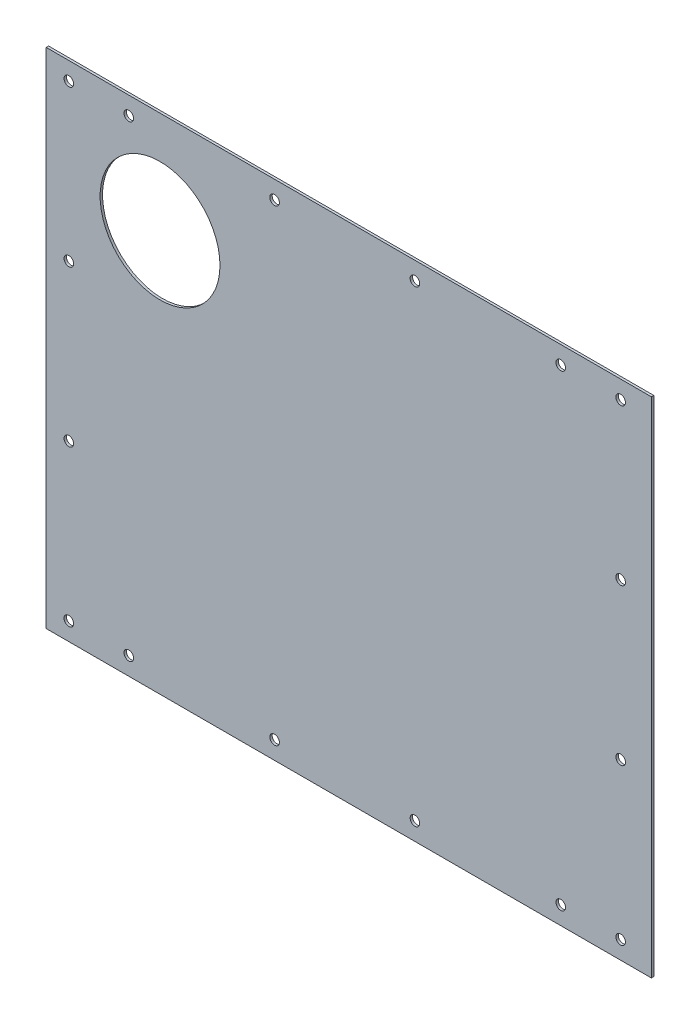
ISO-10303-21;
HEADER;
FILE_DESCRIPTION(('STEP AP214'),'2;1');
FILE_NAME('part.step','',(''),(''),'','','');
FILE_SCHEMA(('AUTOMOTIVE_DESIGN { 1 0 10303 214 1 1 1 1 }'));
ENDSEC;
DATA;
#1=APPLICATION_CONTEXT('core data for automotive mechanical design processes');
#2=APPLICATION_PROTOCOL_DEFINITION('international standard','automotive_design',2000,#1);
#3=PRODUCT_CONTEXT('',#1,'mechanical');
#4=PRODUCT('Part','Part','',(#3));
#5=PRODUCT_RELATED_PRODUCT_CATEGORY('part','',(#4));
#6=PRODUCT_DEFINITION_FORMATION('','',#4);
#7=PRODUCT_DEFINITION_CONTEXT('part definition',#1,'design');
#8=PRODUCT_DEFINITION('design','',#6,#7);
#9=PRODUCT_DEFINITION_SHAPE('','',#8);
#10=(LENGTH_UNIT() NAMED_UNIT(*) SI_UNIT(.MILLI.,.METRE.));
#11=(NAMED_UNIT(*) PLANE_ANGLE_UNIT() SI_UNIT($,.RADIAN.));
#12=(NAMED_UNIT(*) SI_UNIT($,.STERADIAN.) SOLID_ANGLE_UNIT());
#13=UNCERTAINTY_MEASURE_WITH_UNIT(LENGTH_MEASURE(1.E-05),#10,'distance_accuracy_value','');
#14=(GEOMETRIC_REPRESENTATION_CONTEXT(3) GLOBAL_UNCERTAINTY_ASSIGNED_CONTEXT((#13)) GLOBAL_UNIT_ASSIGNED_CONTEXT((#10,
#11,#12)) REPRESENTATION_CONTEXT('',''));
#15=CARTESIAN_POINT('',(0.,0.,0.));
#16=DIRECTION('',(0.,0.,1.));
#17=DIRECTION('',(1.,0.,0.));
#18=AXIS2_PLACEMENT_3D('',#15,#16,#17);
#19=CARTESIAN_POINT('',(-252.5,212.5,2.00000000000011));
#20=DIRECTION('',(0.999999999999999,0.,0.));
#21=DIRECTION('',(0.,1.,0.));
#22=AXIS2_PLACEMENT_3D('',#19,#20,#21);
#23=PLANE('',#22);
#24=DIRECTION('',(0.,-1.,0.));
#25=VECTOR('',#24,1.);
#26=CARTESIAN_POINT('',(-252.5,212.5,1.11022302462516E-13));
#27=LINE('',#26,#25);
#28=CARTESIAN_POINT('',(-252.5,212.5,1.11022302462516E-13));
#29=VERTEX_POINT('',#28);
#30=CARTESIAN_POINT('',(-252.5,-207.5,1.11022302462516E-13));
#31=VERTEX_POINT('',#30);
#32=EDGE_CURVE('E100',#29,#31,#27,.T.);
#33=ORIENTED_EDGE('',*,*,#32,.T.);
#34=DIRECTION('',(0.,0.,-0.999999999999999));
#35=VECTOR('',#34,1.);
#36=CARTESIAN_POINT('',(-252.5,-207.5,2.00000000000011));
#37=LINE('',#36,#35);
#38=CARTESIAN_POINT('',(-252.5,-207.5,2.00000000000011));
#39=VERTEX_POINT('',#38);
#40=EDGE_CURVE('E11',#39,#31,#37,.T.);
#41=ORIENTED_EDGE('',*,*,#40,.F.);
#42=DIRECTION('',(0.,-1.,0.));
#43=VECTOR('',#42,1.);
#44=CARTESIAN_POINT('',(-252.5,212.5,2.00000000000011));
#45=LINE('',#44,#43);
#46=CARTESIAN_POINT('',(-252.5,212.5,2.00000000000011));
#47=VERTEX_POINT('',#46);
#48=EDGE_CURVE('E87',#47,#39,#45,.T.);
#49=ORIENTED_EDGE('',*,*,#48,.F.);
#50=DIRECTION('',(0.,0.,-0.999999999999999));
#51=VECTOR('',#50,1.);
#52=CARTESIAN_POINT('',(-252.5,212.5,2.00000000000011));
#53=LINE('',#52,#51);
#54=EDGE_CURVE('E96',#47,#29,#53,.T.);
#55=ORIENTED_EDGE('',*,*,#54,.T.);
#56=EDGE_LOOP('',(#33,#41,#49,#55));
#57=FACE_BOUND('',#56,.T.);
#58=ADVANCED_FACE('F34',(#57),#23,.F.);
#59=CARTESIAN_POINT('',(-252.5,-207.5,2.00000000000011));
#60=DIRECTION('',(0.,1.,0.));
#61=DIRECTION('',(0.,0.,0.999999999999999));
#62=AXIS2_PLACEMENT_3D('',#59,#60,#61);
#63=PLANE('',#62);
#64=DIRECTION('',(0.999999999999999,0.,0.));
#65=VECTOR('',#64,1.);
#66=CARTESIAN_POINT('',(-252.5,-207.5,1.11022302462516E-13));
#67=LINE('',#66,#65);
#68=CARTESIAN_POINT('',(252.5,-207.5,-2.22044604925031E-13));
#69=VERTEX_POINT('',#68);
#70=EDGE_CURVE('E91',#31,#69,#67,.T.);
#71=ORIENTED_EDGE('',*,*,#70,.T.);
#72=DIRECTION('',(0.,0.,-0.999999999999999));
#73=VECTOR('',#72,1.);
#74=CARTESIAN_POINT('',(252.5,-207.5,2.));
#75=LINE('',#74,#73);
#76=CARTESIAN_POINT('',(252.5,-207.5,2.));
#77=VERTEX_POINT('',#76);
#78=EDGE_CURVE('E43',#77,#69,#75,.T.);
#79=ORIENTED_EDGE('',*,*,#78,.F.);
#80=DIRECTION('',(0.999999999999999,0.,0.));
#81=VECTOR('',#80,1.);
#82=CARTESIAN_POINT('',(-252.5,-207.5,2.00000000000011));
#83=LINE('',#82,#81);
#84=EDGE_CURVE('E82',#39,#77,#83,.T.);
#85=ORIENTED_EDGE('',*,*,#84,.F.);
#86=ORIENTED_EDGE('',*,*,#40,.T.);
#87=EDGE_LOOP('',(#71,#79,#85,#86));
#88=FACE_BOUND('',#87,.T.);
#89=ADVANCED_FACE('F90',(#88),#63,.F.);
#90=CARTESIAN_POINT('',(252.5,212.5,1.99999999999989));
#91=DIRECTION('',(-0.999999999999999,0.,0.));
#92=DIRECTION('',(0.,-1.,0.));
#93=AXIS2_PLACEMENT_3D('',#90,#91,#92);
#94=PLANE('',#93);
#95=DIRECTION('',(0.,1.,0.));
#96=VECTOR('',#95,1.);
#97=CARTESIAN_POINT('',(252.5,212.5,1.11022302462516E-13));
#98=LINE('',#97,#96);
#99=CARTESIAN_POINT('',(252.5,212.5,1.11022302462516E-13));
#100=VERTEX_POINT('',#99);
#101=EDGE_CURVE('E69',#69,#100,#98,.T.);
#102=ORIENTED_EDGE('',*,*,#101,.T.);
#103=DIRECTION('',(0.,0.,-0.999999999999999));
#104=VECTOR('',#103,1.);
#105=CARTESIAN_POINT('',(252.5,212.5,1.99999999999989));
#106=LINE('',#105,#104);
#107=CARTESIAN_POINT('',(252.5,212.5,1.99999999999989));
#108=VERTEX_POINT('',#107);
#109=EDGE_CURVE('E92',#108,#100,#106,.T.);
#110=ORIENTED_EDGE('',*,*,#109,.F.);
#111=DIRECTION('',(0.,1.,0.));
#112=VECTOR('',#111,1.);
#113=CARTESIAN_POINT('',(252.5,212.5,1.99999999999989));
#114=LINE('',#113,#112);
#115=EDGE_CURVE('E85',#77,#108,#114,.T.);
#116=ORIENTED_EDGE('',*,*,#115,.F.);
#117=ORIENTED_EDGE('',*,*,#78,.T.);
#118=EDGE_LOOP('',(#102,#110,#116,#117));
#119=FACE_BOUND('',#118,.T.);
#120=ADVANCED_FACE('F94',(#119),#94,.F.);
#121=CARTESIAN_POINT('',(-252.5,212.5,2.00000000000011));
#122=DIRECTION('',(0.,-1.,0.));
#123=DIRECTION('',(0.,0.,-0.999999999999999));
#124=AXIS2_PLACEMENT_3D('',#121,#122,#123);
#125=PLANE('',#124);
#126=DIRECTION('',(-0.999999999999999,0.,0.));
#127=VECTOR('',#126,1.);
#128=CARTESIAN_POINT('',(-252.5,212.5,1.11022302462516E-13));
#129=LINE('',#128,#127);
#130=EDGE_CURVE('E75',#100,#29,#129,.T.);
#131=ORIENTED_EDGE('',*,*,#130,.T.);
#132=ORIENTED_EDGE('',*,*,#54,.F.);
#133=DIRECTION('',(-0.999999999999999,0.,0.));
#134=VECTOR('',#133,1.);
#135=CARTESIAN_POINT('',(-252.5,212.5,2.00000000000011));
#136=LINE('',#135,#134);
#137=EDGE_CURVE('E52',#108,#47,#136,.T.);
#138=ORIENTED_EDGE('',*,*,#137,.F.);
#139=ORIENTED_EDGE('',*,*,#109,.T.);
#140=EDGE_LOOP('',(#131,#132,#138,#139));
#141=FACE_BOUND('',#140,.T.);
#142=ADVANCED_FACE('F216',(#141),#125,.F.);
#143=CARTESIAN_POINT('',(0.,1.11022302462516E-13,2.));
#144=DIRECTION('',(0.,0.,0.999999999999999));
#145=DIRECTION('',(0.999999999999999,0.,0.));
#146=AXIS2_PLACEMENT_3D('',#143,#144,#145);
#147=PLANE('',#146);
#148=CARTESIAN_POINT('',(-233.6,67.5000000000001,2.));
#149=DIRECTION('',(0.,0.,0.999999999999999));
#150=DIRECTION('',(0.999999999999999,0.,0.));
#151=AXIS2_PLACEMENT_3D('',#148,#149,#150);
#152=CIRCLE('',#151,3.99999999999999);
#153=CARTESIAN_POINT('',(-229.6,67.5000000000001,2.));
#154=VERTEX_POINT('',#153);
#155=EDGE_CURVE('E179',#154,#154,#152,.T.);
#156=ORIENTED_EDGE('',*,*,#155,.F.);
#157=EDGE_LOOP('',(#156));
#158=FACE_BOUND('',#157,.T.);
#159=CARTESIAN_POINT('',(-233.6,-62.4999999999999,2.));
#160=DIRECTION('',(0.,0.,0.999999999999999));
#161=DIRECTION('',(0.999999999999999,0.,0.));
#162=AXIS2_PLACEMENT_3D('',#159,#160,#161);
#163=CIRCLE('',#162,3.99999999999999);
#164=CARTESIAN_POINT('',(-229.6,-62.4999999999999,2.));
#165=VERTEX_POINT('',#164);
#166=EDGE_CURVE('E169',#165,#165,#163,.T.);
#167=ORIENTED_EDGE('',*,*,#166,.F.);
#168=EDGE_LOOP('',(#167));
#169=FACE_BOUND('',#168,.T.);
#170=CARTESIAN_POINT('',(-233.6,-192.5,2.));
#171=DIRECTION('',(0.,0.,0.999999999999999));
#172=DIRECTION('',(0.999999999999999,0.,0.));
#173=AXIS2_PLACEMENT_3D('',#170,#171,#172);
#174=CIRCLE('',#173,3.99999999999999);
#175=CARTESIAN_POINT('',(-229.6,-192.5,2.));
#176=VERTEX_POINT('',#175);
#177=EDGE_CURVE('E166',#176,#176,#174,.T.);
#178=ORIENTED_EDGE('',*,*,#177,.F.);
#179=EDGE_LOOP('',(#178));
#180=FACE_BOUND('',#179,.T.);
#181=CARTESIAN_POINT('',(-183.6,-192.5,1.99999999999978));
#182=DIRECTION('',(0.,0.,0.999999999999999));
#183=DIRECTION('',(0.999999999999999,0.,0.));
#184=AXIS2_PLACEMENT_3D('',#181,#182,#183);
#185=CIRCLE('',#184,3.99999999999999);
#186=CARTESIAN_POINT('',(-179.6,-192.5,1.99999999999978));
#187=VERTEX_POINT('',#186);
#188=EDGE_CURVE('E163',#187,#187,#185,.T.);
#189=ORIENTED_EDGE('',*,*,#188,.F.);
#190=EDGE_LOOP('',(#189));
#191=FACE_BOUND('',#190,.T.);
#192=CARTESIAN_POINT('',(-61.9300000000001,-192.5,2.00000000000011));
#193=DIRECTION('',(0.,0.,0.999999999999999));
#194=DIRECTION('',(0.999999999999999,0.,0.));
#195=AXIS2_PLACEMENT_3D('',#192,#193,#194);
#196=CIRCLE('',#195,4.00000000000001);
#197=CARTESIAN_POINT('',(-57.9300000000001,-192.5,2.00000000000011));
#198=VERTEX_POINT('',#197);
#199=EDGE_CURVE('E159',#198,#198,#196,.T.);
#200=ORIENTED_EDGE('',*,*,#199,.F.);
#201=EDGE_LOOP('',(#200));
#202=FACE_BOUND('',#201,.T.);
#203=CARTESIAN_POINT('',(55.17,-192.5,2.));
#204=DIRECTION('',(0.,0.,0.999999999999999));
#205=DIRECTION('',(0.999999999999999,0.,0.));
#206=AXIS2_PLACEMENT_3D('',#203,#204,#205);
#207=CIRCLE('',#206,4.00000000000001);
#208=CARTESIAN_POINT('',(59.17,-192.5,2.));
#209=VERTEX_POINT('',#208);
#210=EDGE_CURVE('E155',#209,#209,#207,.T.);
#211=ORIENTED_EDGE('',*,*,#210,.F.);
#212=EDGE_LOOP('',(#211));
#213=FACE_BOUND('',#212,.T.);
#214=CARTESIAN_POINT('',(176.84,-192.5,1.99999999999989));
#215=DIRECTION('',(0.,0.,0.999999999999999));
#216=DIRECTION('',(0.999999999999999,0.,0.));
#217=AXIS2_PLACEMENT_3D('',#214,#215,#216);
#218=CIRCLE('',#217,3.99999999999999);
#219=CARTESIAN_POINT('',(180.84,-192.5,1.99999999999989));
#220=VERTEX_POINT('',#219);
#221=EDGE_CURVE('E151',#220,#220,#218,.T.);
#222=ORIENTED_EDGE('',*,*,#221,.F.);
#223=EDGE_LOOP('',(#222));
#224=FACE_BOUND('',#223,.T.);
#225=CARTESIAN_POINT('',(226.84,-192.5,1.99999999999978));
#226=DIRECTION('',(0.,0.,0.999999999999999));
#227=DIRECTION('',(0.999999999999999,0.,0.));
#228=AXIS2_PLACEMENT_3D('',#225,#226,#227);
#229=CIRCLE('',#228,3.99999999999999);
#230=CARTESIAN_POINT('',(230.84,-192.5,1.99999999999978));
#231=VERTEX_POINT('',#230);
#232=EDGE_CURVE('E147',#231,#231,#229,.T.);
#233=ORIENTED_EDGE('',*,*,#232,.F.);
#234=EDGE_LOOP('',(#233));
#235=FACE_BOUND('',#234,.T.);
#236=CARTESIAN_POINT('',(226.84,-62.4999999999999,1.99999999999978));
#237=DIRECTION('',(0.,0.,0.999999999999999));
#238=DIRECTION('',(0.999999999999999,0.,0.));
#239=AXIS2_PLACEMENT_3D('',#236,#237,#238);
#240=CIRCLE('',#239,3.99999999999999);
#241=CARTESIAN_POINT('',(230.84,-62.4999999999999,1.99999999999978));
#242=VERTEX_POINT('',#241);
#243=EDGE_CURVE('E143',#242,#242,#240,.T.);
#244=ORIENTED_EDGE('',*,*,#243,.F.);
#245=EDGE_LOOP('',(#244));
#246=FACE_BOUND('',#245,.T.);
#247=CARTESIAN_POINT('',(226.84,67.5,1.99999999999989));
#248=DIRECTION('',(0.,0.,0.999999999999999));
#249=DIRECTION('',(0.999999999999999,0.,0.));
#250=AXIS2_PLACEMENT_3D('',#247,#248,#249);
#251=CIRCLE('',#250,3.99999999999999);
#252=CARTESIAN_POINT('',(230.84,67.5,1.99999999999989));
#253=VERTEX_POINT('',#252);
#254=EDGE_CURVE('E139',#253,#253,#251,.T.);
#255=ORIENTED_EDGE('',*,*,#254,.F.);
#256=EDGE_LOOP('',(#255));
#257=FACE_BOUND('',#256,.T.);
#258=CARTESIAN_POINT('',(226.84,197.5,1.99999999999956));
#259=DIRECTION('',(0.,0.,0.999999999999999));
#260=DIRECTION('',(0.999999999999999,0.,0.));
#261=AXIS2_PLACEMENT_3D('',#258,#259,#260);
#262=CIRCLE('',#261,3.99999999999999);
#263=CARTESIAN_POINT('',(230.84,197.5,1.99999999999956));
#264=VERTEX_POINT('',#263);
#265=EDGE_CURVE('E135',#264,#264,#262,.T.);
#266=ORIENTED_EDGE('',*,*,#265,.F.);
#267=EDGE_LOOP('',(#266));
#268=FACE_BOUND('',#267,.T.);
#269=CARTESIAN_POINT('',(176.84,197.5,1.99999999999967));
#270=DIRECTION('',(0.,0.,0.999999999999999));
#271=DIRECTION('',(0.999999999999999,0.,0.));
#272=AXIS2_PLACEMENT_3D('',#269,#270,#271);
#273=CIRCLE('',#272,3.99999999999999);
#274=CARTESIAN_POINT('',(180.84,197.5,1.99999999999967));
#275=VERTEX_POINT('',#274);
#276=EDGE_CURVE('E131',#275,#275,#273,.T.);
#277=ORIENTED_EDGE('',*,*,#276,.F.);
#278=EDGE_LOOP('',(#277));
#279=FACE_BOUND('',#278,.T.);
#280=CARTESIAN_POINT('',(55.1699999999999,197.5,2.));
#281=DIRECTION('',(0.,0.,0.999999999999999));
#282=DIRECTION('',(0.999999999999999,0.,0.));
#283=AXIS2_PLACEMENT_3D('',#280,#281,#282);
#284=CIRCLE('',#283,4.00000000000001);
#285=CARTESIAN_POINT('',(59.1699999999999,197.5,2.));
#286=VERTEX_POINT('',#285);
#287=EDGE_CURVE('E127',#286,#286,#284,.T.);
#288=ORIENTED_EDGE('',*,*,#287,.F.);
#289=EDGE_LOOP('',(#288));
#290=FACE_BOUND('',#289,.T.);
#291=CARTESIAN_POINT('',(-61.93,197.5,1.99999999999978));
#292=DIRECTION('',(0.,0.,0.999999999999999));
#293=DIRECTION('',(0.999999999999999,0.,0.));
#294=AXIS2_PLACEMENT_3D('',#291,#292,#293);
#295=CIRCLE('',#294,4.00000000000001);
#296=CARTESIAN_POINT('',(-57.93,197.5,1.99999999999978));
#297=VERTEX_POINT('',#296);
#298=EDGE_CURVE('E123',#297,#297,#295,.T.);
#299=ORIENTED_EDGE('',*,*,#298,.F.);
#300=EDGE_LOOP('',(#299));
#301=FACE_BOUND('',#300,.T.);
#302=CARTESIAN_POINT('',(-183.6,197.5,1.99999999999956));
#303=DIRECTION('',(0.,0.,0.999999999999999));
#304=DIRECTION('',(0.999999999999999,0.,0.));
#305=AXIS2_PLACEMENT_3D('',#302,#303,#304);
#306=CIRCLE('',#305,3.99999999999999);
#307=CARTESIAN_POINT('',(-179.6,197.5,1.99999999999956));
#308=VERTEX_POINT('',#307);
#309=EDGE_CURVE('E119',#308,#308,#306,.T.);
#310=ORIENTED_EDGE('',*,*,#309,.F.);
#311=EDGE_LOOP('',(#310));
#312=FACE_BOUND('',#311,.T.);
#313=CARTESIAN_POINT('',(-233.6,197.5,1.99999999999978));
#314=DIRECTION('',(0.,0.,0.999999999999999));
#315=DIRECTION('',(0.999999999999999,0.,0.));
#316=AXIS2_PLACEMENT_3D('',#313,#314,#315);
#317=CIRCLE('',#316,3.99999999999999);
#318=CARTESIAN_POINT('',(-229.6,197.5,1.99999999999978));
#319=VERTEX_POINT('',#318);
#320=EDGE_CURVE('E115',#319,#319,#317,.T.);
#321=ORIENTED_EDGE('',*,*,#320,.F.);
#322=EDGE_LOOP('',(#321));
#323=FACE_BOUND('',#322,.T.);
#324=CARTESIAN_POINT('',(-157.5,127.5,1.99999999999978));
#325=DIRECTION('',(0.,0.,0.999999999999999));
#326=DIRECTION('',(0.999999999999999,0.,0.));
#327=AXIS2_PLACEMENT_3D('',#324,#325,#326);
#328=CIRCLE('',#327,50.);
#329=CARTESIAN_POINT('',(-107.5,127.5,1.99999999999978));
#330=VERTEX_POINT('',#329);
#331=EDGE_CURVE('E111',#330,#330,#328,.T.);
#332=ORIENTED_EDGE('',*,*,#331,.F.);
#333=EDGE_LOOP('',(#332));
#334=FACE_BOUND('',#333,.T.);
#335=ORIENTED_EDGE('',*,*,#48,.T.);
#336=ORIENTED_EDGE('',*,*,#84,.T.);
#337=ORIENTED_EDGE('',*,*,#115,.T.);
#338=ORIENTED_EDGE('',*,*,#137,.T.);
#339=EDGE_LOOP('',(#335,#336,#337,#338));
#340=FACE_BOUND('',#339,.T.);
#341=ADVANCED_FACE('F83',(#158,#169,#180,#191,#202,#213,#224,#235,#246,#257,#268,#279,#290,#301,
#312,#323,#334,#340),#147,.T.);
#342=CARTESIAN_POINT('',(0.,0.,0.));
#343=DIRECTION('',(0.,0.,0.999999999999999));
#344=DIRECTION('',(0.999999999999999,0.,0.));
#345=AXIS2_PLACEMENT_3D('',#342,#343,#344);
#346=PLANE('',#345);
#347=CARTESIAN_POINT('',(-233.6,67.5,0.));
#348=DIRECTION('',(0.,0.,0.999999999999999));
#349=DIRECTION('',(0.999999999999999,0.,0.));
#350=AXIS2_PLACEMENT_3D('',#347,#348,#349);
#351=CIRCLE('',#350,3.99999999999999);
#352=CARTESIAN_POINT('',(-229.6,67.5,0.));
#353=VERTEX_POINT('',#352);
#354=EDGE_CURVE('E37',#353,#353,#351,.T.);
#355=ORIENTED_EDGE('',*,*,#354,.T.);
#356=EDGE_LOOP('',(#355));
#357=FACE_BOUND('',#356,.T.);
#358=CARTESIAN_POINT('',(-233.6,-62.4999999999999,3.33066907387547E-13));
#359=DIRECTION('',(0.,0.,0.999999999999999));
#360=DIRECTION('',(0.999999999999999,0.,0.));
#361=AXIS2_PLACEMENT_3D('',#358,#359,#360);
#362=CIRCLE('',#361,3.99999999999999);
#363=CARTESIAN_POINT('',(-229.6,-62.4999999999999,3.33066907387547E-13));
#364=VERTEX_POINT('',#363);
#365=EDGE_CURVE('E167',#364,#364,#362,.T.);
#366=ORIENTED_EDGE('',*,*,#365,.T.);
#367=EDGE_LOOP('',(#366));
#368=FACE_BOUND('',#367,.T.);
#369=CARTESIAN_POINT('',(-233.6,-192.5,1.11022302462516E-13));
#370=DIRECTION('',(0.,0.,0.999999999999999));
#371=DIRECTION('',(0.999999999999999,0.,0.));
#372=AXIS2_PLACEMENT_3D('',#369,#370,#371);
#373=CIRCLE('',#372,3.99999999999999);
#374=CARTESIAN_POINT('',(-229.6,-192.5,1.11022302462516E-13));
#375=VERTEX_POINT('',#374);
#376=EDGE_CURVE('E164',#375,#375,#373,.T.);
#377=ORIENTED_EDGE('',*,*,#376,.T.);
#378=EDGE_LOOP('',(#377));
#379=FACE_BOUND('',#378,.T.);
#380=CARTESIAN_POINT('',(-183.6,-192.5,1.11022302462516E-13));
#381=DIRECTION('',(0.,0.,0.999999999999999));
#382=DIRECTION('',(0.999999999999999,0.,0.));
#383=AXIS2_PLACEMENT_3D('',#380,#381,#382);
#384=CIRCLE('',#383,3.99999999999999);
#385=CARTESIAN_POINT('',(-179.6,-192.5,1.11022302462516E-13));
#386=VERTEX_POINT('',#385);
#387=EDGE_CURVE('E160',#386,#386,#384,.T.);
#388=ORIENTED_EDGE('',*,*,#387,.T.);
#389=EDGE_LOOP('',(#388));
#390=FACE_BOUND('',#389,.T.);
#391=CARTESIAN_POINT('',(-61.9300000000001,-192.5,1.11022302462516E-13));
#392=DIRECTION('',(0.,0.,0.999999999999999));
#393=DIRECTION('',(0.999999999999999,0.,0.));
#394=AXIS2_PLACEMENT_3D('',#391,#392,#393);
#395=CIRCLE('',#394,4.00000000000001);
#396=CARTESIAN_POINT('',(-57.9300000000001,-192.5,1.11022302462516E-13));
#397=VERTEX_POINT('',#396);
#398=EDGE_CURVE('E156',#397,#397,#395,.T.);
#399=ORIENTED_EDGE('',*,*,#398,.T.);
#400=EDGE_LOOP('',(#399));
#401=FACE_BOUND('',#400,.T.);
#402=CARTESIAN_POINT('',(55.1699999999999,-192.5,1.11022302462516E-13));
#403=DIRECTION('',(0.,0.,0.999999999999999));
#404=DIRECTION('',(0.999999999999999,0.,0.));
#405=AXIS2_PLACEMENT_3D('',#402,#403,#404);
#406=CIRCLE('',#405,4.00000000000001);
#407=CARTESIAN_POINT('',(59.1699999999999,-192.5,1.11022302462516E-13));
#408=VERTEX_POINT('',#407);
#409=EDGE_CURVE('E152',#408,#408,#406,.T.);
#410=ORIENTED_EDGE('',*,*,#409,.T.);
#411=EDGE_LOOP('',(#410));
#412=FACE_BOUND('',#411,.T.);
#413=CARTESIAN_POINT('',(176.84,-192.5,-1.11022302462516E-13));
#414=DIRECTION('',(0.,0.,0.999999999999999));
#415=DIRECTION('',(0.999999999999999,0.,0.));
#416=AXIS2_PLACEMENT_3D('',#413,#414,#415);
#417=CIRCLE('',#416,3.99999999999999);
#418=CARTESIAN_POINT('',(180.84,-192.5,-1.11022302462516E-13));
#419=VERTEX_POINT('',#418);
#420=EDGE_CURVE('E148',#419,#419,#417,.T.);
#421=ORIENTED_EDGE('',*,*,#420,.T.);
#422=EDGE_LOOP('',(#421));
#423=FACE_BOUND('',#422,.T.);
#424=CARTESIAN_POINT('',(226.84,-192.5,0.));
#425=DIRECTION('',(0.,0.,0.999999999999999));
#426=DIRECTION('',(0.999999999999999,0.,0.));
#427=AXIS2_PLACEMENT_3D('',#424,#425,#426);
#428=CIRCLE('',#427,3.99999999999999);
#429=CARTESIAN_POINT('',(230.84,-192.5,0.));
#430=VERTEX_POINT('',#429);
#431=EDGE_CURVE('E144',#430,#430,#428,.T.);
#432=ORIENTED_EDGE('',*,*,#431,.T.);
#433=EDGE_LOOP('',(#432));
#434=FACE_BOUND('',#433,.T.);
#435=CARTESIAN_POINT('',(226.84,-62.5,0.));
#436=DIRECTION('',(0.,0.,0.999999999999999));
#437=DIRECTION('',(0.999999999999999,0.,0.));
#438=AXIS2_PLACEMENT_3D('',#435,#436,#437);
#439=CIRCLE('',#438,3.99999999999999);
#440=CARTESIAN_POINT('',(230.84,-62.5,0.));
#441=VERTEX_POINT('',#440);
#442=EDGE_CURVE('E140',#441,#441,#439,.T.);
#443=ORIENTED_EDGE('',*,*,#442,.T.);
#444=EDGE_LOOP('',(#443));
#445=FACE_BOUND('',#444,.T.);
#446=CARTESIAN_POINT('',(226.84,67.5,-2.22044604925031E-13));
#447=DIRECTION('',(0.,0.,0.999999999999999));
#448=DIRECTION('',(0.999999999999999,0.,0.));
#449=AXIS2_PLACEMENT_3D('',#446,#447,#448);
#450=CIRCLE('',#449,3.99999999999999);
#451=CARTESIAN_POINT('',(230.84,67.5,-2.22044604925031E-13));
#452=VERTEX_POINT('',#451);
#453=EDGE_CURVE('E136',#452,#452,#450,.T.);
#454=ORIENTED_EDGE('',*,*,#453,.T.);
#455=EDGE_LOOP('',(#454));
#456=FACE_BOUND('',#455,.T.);
#457=CARTESIAN_POINT('',(226.84,197.5,0.));
#458=DIRECTION('',(0.,0.,0.999999999999999));
#459=DIRECTION('',(0.999999999999999,0.,0.));
#460=AXIS2_PLACEMENT_3D('',#457,#458,#459);
#461=CIRCLE('',#460,3.99999999999999);
#462=CARTESIAN_POINT('',(230.84,197.5,0.));
#463=VERTEX_POINT('',#462);
#464=EDGE_CURVE('E132',#463,#463,#461,.T.);
#465=ORIENTED_EDGE('',*,*,#464,.T.);
#466=EDGE_LOOP('',(#465));
#467=FACE_BOUND('',#466,.T.);
#468=CARTESIAN_POINT('',(176.84,197.5,-4.44089209850063E-13));
#469=DIRECTION('',(0.,0.,0.999999999999999));
#470=DIRECTION('',(0.999999999999999,0.,0.));
#471=AXIS2_PLACEMENT_3D('',#468,#469,#470);
#472=CIRCLE('',#471,3.99999999999999);
#473=CARTESIAN_POINT('',(180.84,197.5,-4.44089209850063E-13));
#474=VERTEX_POINT('',#473);
#475=EDGE_CURVE('E128',#474,#474,#472,.T.);
#476=ORIENTED_EDGE('',*,*,#475,.T.);
#477=EDGE_LOOP('',(#476));
#478=FACE_BOUND('',#477,.T.);
#479=CARTESIAN_POINT('',(55.1699999999998,197.5,-4.44089209850063E-13));
#480=DIRECTION('',(0.,0.,0.999999999999999));
#481=DIRECTION('',(0.999999999999999,0.,0.));
#482=AXIS2_PLACEMENT_3D('',#479,#480,#481);
#483=CIRCLE('',#482,4.00000000000001);
#484=CARTESIAN_POINT('',(59.1699999999998,197.5,-4.44089209850063E-13));
#485=VERTEX_POINT('',#484);
#486=EDGE_CURVE('E124',#485,#485,#483,.T.);
#487=ORIENTED_EDGE('',*,*,#486,.T.);
#488=EDGE_LOOP('',(#487));
#489=FACE_BOUND('',#488,.T.);
#490=CARTESIAN_POINT('',(-61.9300000000001,197.5,-4.44089209850063E-13));
#491=DIRECTION('',(0.,0.,0.999999999999999));
#492=DIRECTION('',(0.999999999999999,0.,0.));
#493=AXIS2_PLACEMENT_3D('',#490,#491,#492);
#494=CIRCLE('',#493,4.00000000000001);
#495=CARTESIAN_POINT('',(-57.9300000000001,197.5,-4.44089209850063E-13));
#496=VERTEX_POINT('',#495);
#497=EDGE_CURVE('E120',#496,#496,#494,.T.);
#498=ORIENTED_EDGE('',*,*,#497,.T.);
#499=EDGE_LOOP('',(#498));
#500=FACE_BOUND('',#499,.T.);
#501=CARTESIAN_POINT('',(-183.6,197.5,-1.11022302462516E-13));
#502=DIRECTION('',(0.,0.,0.999999999999999));
#503=DIRECTION('',(0.999999999999999,0.,0.));
#504=AXIS2_PLACEMENT_3D('',#501,#502,#503);
#505=CIRCLE('',#504,3.99999999999999);
#506=CARTESIAN_POINT('',(-179.6,197.5,-1.11022302462516E-13));
#507=VERTEX_POINT('',#506);
#508=EDGE_CURVE('E116',#507,#507,#505,.T.);
#509=ORIENTED_EDGE('',*,*,#508,.T.);
#510=EDGE_LOOP('',(#509));
#511=FACE_BOUND('',#510,.T.);
#512=CARTESIAN_POINT('',(-233.6,197.5,2.22044604925031E-13));
#513=DIRECTION('',(0.,0.,0.999999999999999));
#514=DIRECTION('',(0.999999999999999,0.,0.));
#515=AXIS2_PLACEMENT_3D('',#512,#513,#514);
#516=CIRCLE('',#515,3.99999999999999);
#517=CARTESIAN_POINT('',(-229.6,197.5,2.22044604925031E-13));
#518=VERTEX_POINT('',#517);
#519=EDGE_CURVE('E112',#518,#518,#516,.T.);
#520=ORIENTED_EDGE('',*,*,#519,.T.);
#521=EDGE_LOOP('',(#520));
#522=FACE_BOUND('',#521,.T.);
#523=CARTESIAN_POINT('',(-157.5,127.5,0.));
#524=DIRECTION('',(0.,0.,0.999999999999999));
#525=DIRECTION('',(0.999999999999999,0.,0.));
#526=AXIS2_PLACEMENT_3D('',#523,#524,#525);
#527=CIRCLE('',#526,50.);
#528=CARTESIAN_POINT('',(-107.5,127.5,0.));
#529=VERTEX_POINT('',#528);
#530=EDGE_CURVE('E103',#529,#529,#527,.T.);
#531=ORIENTED_EDGE('',*,*,#530,.T.);
#532=EDGE_LOOP('',(#531));
#533=FACE_BOUND('',#532,.T.);
#534=ORIENTED_EDGE('',*,*,#32,.F.);
#535=ORIENTED_EDGE('',*,*,#130,.F.);
#536=ORIENTED_EDGE('',*,*,#101,.F.);
#537=ORIENTED_EDGE('',*,*,#70,.F.);
#538=EDGE_LOOP('',(#534,#535,#536,#537));
#539=FACE_BOUND('',#538,.T.);
#540=ADVANCED_FACE('F215',(#357,#368,#379,#390,#401,#412,#423,#434,#445,#456,#467,#478,#489,
#500,#511,#522,#533,#539),#346,.F.);
#541=CARTESIAN_POINT('',(-157.5,127.5,-8.00000000000001));
#542=DIRECTION('',(0.,0.,0.999999999999999));
#543=DIRECTION('',(0.999999999999999,0.,0.));
#544=AXIS2_PLACEMENT_3D('',#541,#542,#543);
#545=CYLINDRICAL_SURFACE('',#544,50.);
#546=ORIENTED_EDGE('',*,*,#331,.T.);
#547=EDGE_LOOP('',(#546));
#548=FACE_BOUND('',#547,.T.);
#549=ORIENTED_EDGE('',*,*,#530,.F.);
#550=EDGE_LOOP('',(#549));
#551=FACE_BOUND('',#550,.T.);
#552=ADVANCED_FACE('F211',(#548,#551),#545,.F.);
#553=CARTESIAN_POINT('',(-233.6,197.5,-8.00000000000045));
#554=DIRECTION('',(0.,0.,0.999999999999999));
#555=DIRECTION('',(0.999999999999999,0.,0.));
#556=AXIS2_PLACEMENT_3D('',#553,#554,#555);
#557=CYLINDRICAL_SURFACE('',#556,3.99999999999999);
#558=ORIENTED_EDGE('',*,*,#320,.T.);
#559=EDGE_LOOP('',(#558));
#560=FACE_BOUND('',#559,.T.);
#561=ORIENTED_EDGE('',*,*,#519,.F.);
#562=EDGE_LOOP('',(#561));
#563=FACE_BOUND('',#562,.T.);
#564=ADVANCED_FACE('F259',(#560,#563),#557,.F.);
#565=CARTESIAN_POINT('',(-183.6,197.5,-7.9999999999999));
#566=DIRECTION('',(0.,0.,0.999999999999999));
#567=DIRECTION('',(0.999999999999999,0.,0.));
#568=AXIS2_PLACEMENT_3D('',#565,#566,#567);
#569=CYLINDRICAL_SURFACE('',#568,3.99999999999999);
#570=ORIENTED_EDGE('',*,*,#309,.T.);
#571=EDGE_LOOP('',(#570));
#572=FACE_BOUND('',#571,.T.);
#573=ORIENTED_EDGE('',*,*,#508,.F.);
#574=EDGE_LOOP('',(#573));
#575=FACE_BOUND('',#574,.T.);
#576=ADVANCED_FACE('F265',(#572,#575),#569,.F.);
#577=CARTESIAN_POINT('',(-61.9300000000001,197.5,-8.00000000000012));
#578=DIRECTION('',(0.,0.,0.999999999999999));
#579=DIRECTION('',(0.999999999999999,0.,0.));
#580=AXIS2_PLACEMENT_3D('',#577,#578,#579);
#581=CYLINDRICAL_SURFACE('',#580,4.00000000000001);
#582=ORIENTED_EDGE('',*,*,#298,.T.);
#583=EDGE_LOOP('',(#582));
#584=FACE_BOUND('',#583,.T.);
#585=ORIENTED_EDGE('',*,*,#497,.F.);
#586=EDGE_LOOP('',(#585));
#587=FACE_BOUND('',#586,.T.);
#588=ADVANCED_FACE('F273',(#584,#587),#581,.F.);
#589=CARTESIAN_POINT('',(55.1699999999999,197.5,-8.00000000000023));
#590=DIRECTION('',(0.,0.,0.999999999999999));
#591=DIRECTION('',(0.999999999999999,0.,0.));
#592=AXIS2_PLACEMENT_3D('',#589,#590,#591);
#593=CYLINDRICAL_SURFACE('',#592,4.00000000000001);
#594=ORIENTED_EDGE('',*,*,#287,.T.);
#595=EDGE_LOOP('',(#594));
#596=FACE_BOUND('',#595,.T.);
#597=ORIENTED_EDGE('',*,*,#486,.F.);
#598=EDGE_LOOP('',(#597));
#599=FACE_BOUND('',#598,.T.);
#600=ADVANCED_FACE('F281',(#596,#599),#593,.F.);
#601=CARTESIAN_POINT('',(176.84,197.5,-7.99999999999979));
#602=DIRECTION('',(0.,0.,0.999999999999999));
#603=DIRECTION('',(0.999999999999999,0.,0.));
#604=AXIS2_PLACEMENT_3D('',#601,#602,#603);
#605=CYLINDRICAL_SURFACE('',#604,3.99999999999999);
#606=ORIENTED_EDGE('',*,*,#276,.T.);
#607=EDGE_LOOP('',(#606));
#608=FACE_BOUND('',#607,.T.);
#609=ORIENTED_EDGE('',*,*,#475,.F.);
#610=EDGE_LOOP('',(#609));
#611=FACE_BOUND('',#610,.T.);
#612=ADVANCED_FACE('F289',(#608,#611),#605,.F.);
#613=CARTESIAN_POINT('',(226.84,197.5,-8.00000000000012));
#614=DIRECTION('',(0.,0.,0.999999999999999));
#615=DIRECTION('',(0.999999999999999,0.,0.));
#616=AXIS2_PLACEMENT_3D('',#613,#614,#615);
#617=CYLINDRICAL_SURFACE('',#616,3.99999999999999);
#618=ORIENTED_EDGE('',*,*,#265,.T.);
#619=EDGE_LOOP('',(#618));
#620=FACE_BOUND('',#619,.T.);
#621=ORIENTED_EDGE('',*,*,#464,.F.);
#622=EDGE_LOOP('',(#621));
#623=FACE_BOUND('',#622,.T.);
#624=ADVANCED_FACE('F297',(#620,#623),#617,.F.);
#625=CARTESIAN_POINT('',(226.84,67.5000000000002,-8.00000000000023));
#626=DIRECTION('',(0.,0.,0.999999999999999));
#627=DIRECTION('',(0.999999999999999,0.,0.));
#628=AXIS2_PLACEMENT_3D('',#625,#626,#627);
#629=CYLINDRICAL_SURFACE('',#628,3.99999999999999);
#630=ORIENTED_EDGE('',*,*,#254,.T.);
#631=EDGE_LOOP('',(#630));
#632=FACE_BOUND('',#631,.T.);
#633=ORIENTED_EDGE('',*,*,#453,.F.);
#634=EDGE_LOOP('',(#633));
#635=FACE_BOUND('',#634,.T.);
#636=ADVANCED_FACE('F305',(#632,#635),#629,.F.);
#637=CARTESIAN_POINT('',(226.84,-62.4999999999999,-8.00000000000001));
#638=DIRECTION('',(0.,0.,0.999999999999999));
#639=DIRECTION('',(0.999999999999999,0.,0.));
#640=AXIS2_PLACEMENT_3D('',#637,#638,#639);
#641=CYLINDRICAL_SURFACE('',#640,3.99999999999999);
#642=ORIENTED_EDGE('',*,*,#243,.T.);
#643=EDGE_LOOP('',(#642));
#644=FACE_BOUND('',#643,.T.);
#645=ORIENTED_EDGE('',*,*,#442,.F.);
#646=EDGE_LOOP('',(#645));
#647=FACE_BOUND('',#646,.T.);
#648=ADVANCED_FACE('F313',(#644,#647),#641,.F.);
#649=CARTESIAN_POINT('',(226.84,-192.5,-8.00000000000001));
#650=DIRECTION('',(0.,0.,0.999999999999999));
#651=DIRECTION('',(0.999999999999999,0.,0.));
#652=AXIS2_PLACEMENT_3D('',#649,#650,#651);
#653=CYLINDRICAL_SURFACE('',#652,3.99999999999999);
#654=ORIENTED_EDGE('',*,*,#232,.T.);
#655=EDGE_LOOP('',(#654));
#656=FACE_BOUND('',#655,.T.);
#657=ORIENTED_EDGE('',*,*,#431,.F.);
#658=EDGE_LOOP('',(#657));
#659=FACE_BOUND('',#658,.T.);
#660=ADVANCED_FACE('F321',(#656,#659),#653,.F.);
#661=CARTESIAN_POINT('',(176.84,-192.5,-7.99999999999967));
#662=DIRECTION('',(0.,0.,0.999999999999999));
#663=DIRECTION('',(0.999999999999999,0.,0.));
#664=AXIS2_PLACEMENT_3D('',#661,#662,#663);
#665=CYLINDRICAL_SURFACE('',#664,3.99999999999999);
#666=ORIENTED_EDGE('',*,*,#221,.T.);
#667=EDGE_LOOP('',(#666));
#668=FACE_BOUND('',#667,.T.);
#669=ORIENTED_EDGE('',*,*,#420,.F.);
#670=EDGE_LOOP('',(#669));
#671=FACE_BOUND('',#670,.T.);
#672=ADVANCED_FACE('F329',(#668,#671),#665,.F.);
#673=CARTESIAN_POINT('',(55.1700000000001,-192.5,-8.00000000000023));
#674=DIRECTION('',(0.,0.,0.999999999999999));
#675=DIRECTION('',(0.999999999999999,0.,0.));
#676=AXIS2_PLACEMENT_3D('',#673,#674,#675);
#677=CYLINDRICAL_SURFACE('',#676,4.00000000000001);
#678=ORIENTED_EDGE('',*,*,#210,.T.);
#679=EDGE_LOOP('',(#678));
#680=FACE_BOUND('',#679,.T.);
#681=ORIENTED_EDGE('',*,*,#409,.F.);
#682=EDGE_LOOP('',(#681));
#683=FACE_BOUND('',#682,.T.);
#684=ADVANCED_FACE('F337',(#680,#683),#677,.F.);
#685=CARTESIAN_POINT('',(-61.93,-192.5,-7.9999999999999));
#686=DIRECTION('',(0.,0.,0.999999999999999));
#687=DIRECTION('',(0.999999999999999,0.,0.));
#688=AXIS2_PLACEMENT_3D('',#685,#686,#687);
#689=CYLINDRICAL_SURFACE('',#688,4.00000000000001);
#690=ORIENTED_EDGE('',*,*,#199,.T.);
#691=EDGE_LOOP('',(#690));
#692=FACE_BOUND('',#691,.T.);
#693=ORIENTED_EDGE('',*,*,#398,.F.);
#694=EDGE_LOOP('',(#693));
#695=FACE_BOUND('',#694,.T.);
#696=ADVANCED_FACE('F345',(#692,#695),#689,.F.);
#697=CARTESIAN_POINT('',(-183.6,-192.5,-7.99999999999967));
#698=DIRECTION('',(0.,0.,0.999999999999999));
#699=DIRECTION('',(0.999999999999999,0.,0.));
#700=AXIS2_PLACEMENT_3D('',#697,#698,#699);
#701=CYLINDRICAL_SURFACE('',#700,3.99999999999999);
#702=ORIENTED_EDGE('',*,*,#188,.T.);
#703=EDGE_LOOP('',(#702));
#704=FACE_BOUND('',#703,.T.);
#705=ORIENTED_EDGE('',*,*,#387,.F.);
#706=EDGE_LOOP('',(#705));
#707=FACE_BOUND('',#706,.T.);
#708=ADVANCED_FACE('F353',(#704,#707),#701,.F.);
#709=CARTESIAN_POINT('',(-233.6,-192.5,-8.00000000000001));
#710=DIRECTION('',(0.,0.,0.999999999999999));
#711=DIRECTION('',(0.999999999999999,0.,0.));
#712=AXIS2_PLACEMENT_3D('',#709,#710,#711);
#713=CYLINDRICAL_SURFACE('',#712,3.99999999999999);
#714=ORIENTED_EDGE('',*,*,#177,.T.);
#715=EDGE_LOOP('',(#714));
#716=FACE_BOUND('',#715,.T.);
#717=ORIENTED_EDGE('',*,*,#376,.F.);
#718=EDGE_LOOP('',(#717));
#719=FACE_BOUND('',#718,.T.);
#720=ADVANCED_FACE('F361',(#716,#719),#713,.F.);
#721=CARTESIAN_POINT('',(-233.6,-62.5,-8.00000000000045));
#722=DIRECTION('',(0.,0.,0.999999999999999));
#723=DIRECTION('',(0.999999999999999,0.,0.));
#724=AXIS2_PLACEMENT_3D('',#721,#722,#723);
#725=CYLINDRICAL_SURFACE('',#724,3.99999999999999);
#726=ORIENTED_EDGE('',*,*,#166,.T.);
#727=EDGE_LOOP('',(#726));
#728=FACE_BOUND('',#727,.T.);
#729=ORIENTED_EDGE('',*,*,#365,.F.);
#730=EDGE_LOOP('',(#729));
#731=FACE_BOUND('',#730,.T.);
#732=ADVANCED_FACE('F369',(#728,#731),#725,.F.);
#733=CARTESIAN_POINT('',(-233.6,67.5,-8.00000000000023));
#734=DIRECTION('',(0.,0.,0.999999999999999));
#735=DIRECTION('',(0.999999999999999,0.,0.));
#736=AXIS2_PLACEMENT_3D('',#733,#734,#735);
#737=CYLINDRICAL_SURFACE('',#736,3.99999999999999);
#738=ORIENTED_EDGE('',*,*,#155,.T.);
#739=EDGE_LOOP('',(#738));
#740=FACE_BOUND('',#739,.T.);
#741=ORIENTED_EDGE('',*,*,#354,.F.);
#742=EDGE_LOOP('',(#741));
#743=FACE_BOUND('',#742,.T.);
#744=ADVANCED_FACE('F377',(#740,#743),#737,.F.);
#745=CLOSED_SHELL('',(#58,#89,#120,#142,#341,#540,#552,#564,#576,#588,#600,#612,#624,#636,#648,
#660,#672,#684,#696,#708,#720,#732,#744));
#746=MANIFOLD_SOLID_BREP('B2',#745);
#747=ADVANCED_BREP_SHAPE_REPRESENTATION('',(#18,#746),#14);
#748=SHAPE_DEFINITION_REPRESENTATION(#9,#747);
ENDSEC;
END-ISO-10303-21;
